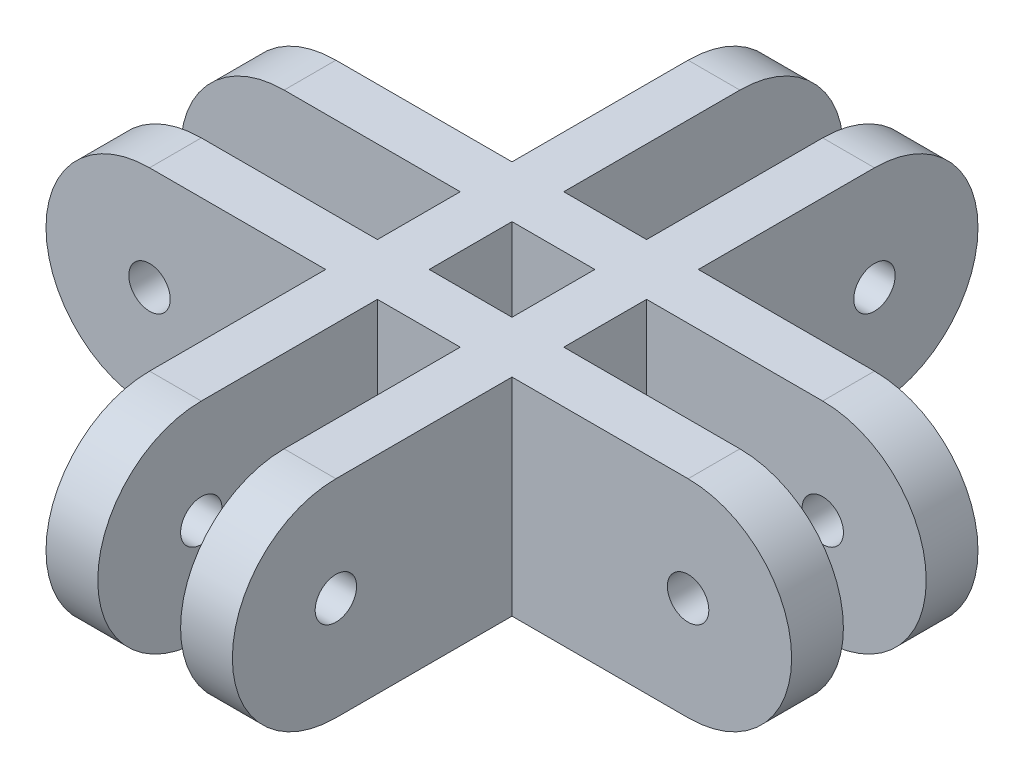
ISO-10303-21;
HEADER;
FILE_DESCRIPTION(('STEP AP214'),'2;1');
FILE_NAME('part.step','',(''),(''),'','','');
FILE_SCHEMA(('AUTOMOTIVE_DESIGN { 1 0 10303 214 1 1 1 1 }'));
ENDSEC;
DATA;
#1=APPLICATION_CONTEXT('core data for automotive mechanical design processes');
#2=APPLICATION_PROTOCOL_DEFINITION('international standard','automotive_design',2000,#1);
#3=PRODUCT_CONTEXT('',#1,'mechanical');
#4=PRODUCT('Part','Part','',(#3));
#5=PRODUCT_RELATED_PRODUCT_CATEGORY('part','',(#4));
#6=PRODUCT_DEFINITION_FORMATION('','',#4);
#7=PRODUCT_DEFINITION_CONTEXT('part definition',#1,'design');
#8=PRODUCT_DEFINITION('design','',#6,#7);
#9=PRODUCT_DEFINITION_SHAPE('','',#8);
#10=(LENGTH_UNIT() NAMED_UNIT(*) SI_UNIT(.MILLI.,.METRE.));
#11=(NAMED_UNIT(*) PLANE_ANGLE_UNIT() SI_UNIT($,.RADIAN.));
#12=(NAMED_UNIT(*) SI_UNIT($,.STERADIAN.) SOLID_ANGLE_UNIT());
#13=UNCERTAINTY_MEASURE_WITH_UNIT(LENGTH_MEASURE(1.E-05),#10,'distance_accuracy_value','');
#14=(GEOMETRIC_REPRESENTATION_CONTEXT(3) GLOBAL_UNCERTAINTY_ASSIGNED_CONTEXT((#13)) GLOBAL_UNIT_ASSIGNED_CONTEXT((#10,
#11,#12)) REPRESENTATION_CONTEXT('',''));
#15=CARTESIAN_POINT('',(0.,0.,0.));
#16=DIRECTION('',(0.,0.,1.));
#17=DIRECTION('',(1.,0.,0.));
#18=AXIS2_PLACEMENT_3D('',#15,#16,#17);
#19=CARTESIAN_POINT('',(0.,0.,5.));
#20=DIRECTION('',(0.,0.,1.));
#21=DIRECTION('',(1.,0.,0.));
#22=AXIS2_PLACEMENT_3D('',#19,#20,#21);
#23=PLANE('',#22);
#24=CARTESIAN_POINT('',(-52.02,0.,5.));
#25=DIRECTION('',(0.,0.,1.));
#26=DIRECTION('',(1.,0.,0.));
#27=AXIS2_PLACEMENT_3D('',#24,#25,#26);
#28=CIRCLE('',#27,2.);
#29=CARTESIAN_POINT('',(-50.02,0.,5.));
#30=VERTEX_POINT('',#29);
#31=EDGE_CURVE('E420',#30,#30,#28,.F.);
#32=ORIENTED_EDGE('',*,*,#31,.T.);
#33=EDGE_LOOP('',(#32));
#34=FACE_BOUND('',#33,.T.);
#35=DIRECTION('',(-1.,0.,0.));
#36=VECTOR('',#35,1.);
#37=CARTESIAN_POINT('',(0.,-10.,5.));
#38=LINE('',#37,#36);
#39=CARTESIAN_POINT('',(-35.01,-10.,5.));
#40=VERTEX_POINT('',#39);
#41=CARTESIAN_POINT('',(-52.02,-10.,5.));
#42=VERTEX_POINT('',#41);
#43=EDGE_CURVE('E408',#40,#42,#38,.T.);
#44=ORIENTED_EDGE('',*,*,#43,.F.);
#45=DIRECTION('',(0.,1.,0.));
#46=VECTOR('',#45,1.);
#47=CARTESIAN_POINT('',(-35.01,0.,5.));
#48=LINE('',#47,#46);
#49=CARTESIAN_POINT('',(-35.01,10.,5.));
#50=VERTEX_POINT('',#49);
#51=EDGE_CURVE('E280',#40,#50,#48,.T.);
#52=ORIENTED_EDGE('',*,*,#51,.T.);
#53=DIRECTION('',(-1.,0.,0.));
#54=VECTOR('',#53,1.);
#55=CARTESIAN_POINT('',(0.,10.,5.));
#56=LINE('',#55,#54);
#57=CARTESIAN_POINT('',(-52.02,10.,5.));
#58=VERTEX_POINT('',#57);
#59=EDGE_CURVE('E416',#50,#58,#56,.T.);
#60=ORIENTED_EDGE('',*,*,#59,.T.);
#61=CARTESIAN_POINT('',(-52.02,0.,5.));
#62=DIRECTION('',(0.,0.,1.));
#63=DIRECTION('',(1.,0.,0.));
#64=AXIS2_PLACEMENT_3D('',#61,#62,#63);
#65=CIRCLE('',#64,10.);
#66=EDGE_CURVE('E405',#42,#58,#65,.F.);
#67=ORIENTED_EDGE('',*,*,#66,.F.);
#68=EDGE_LOOP('',(#44,#52,#60,#67));
#69=FACE_BOUND('',#68,.T.);
#70=ADVANCED_FACE('F34',(#34,#69),#23,.T.);
#71=CARTESIAN_POINT('',(0.,0.,0.));
#72=DIRECTION('',(0.,0.,1.));
#73=DIRECTION('',(1.,0.,0.));
#74=AXIS2_PLACEMENT_3D('',#71,#72,#73);
#75=PLANE('',#74);
#76=CARTESIAN_POINT('',(-52.02,0.,0.));
#77=DIRECTION('',(0.,0.,1.));
#78=DIRECTION('',(1.,0.,0.));
#79=AXIS2_PLACEMENT_3D('',#76,#77,#78);
#80=CIRCLE('',#79,2.);
#81=CARTESIAN_POINT('',(-50.02,0.,0.));
#82=VERTEX_POINT('',#81);
#83=EDGE_CURVE('E440',#82,#82,#80,.F.);
#84=ORIENTED_EDGE('',*,*,#83,.F.);
#85=EDGE_LOOP('',(#84));
#86=FACE_BOUND('',#85,.T.);
#87=DIRECTION('',(0.,1.,0.));
#88=VECTOR('',#87,1.);
#89=CARTESIAN_POINT('',(-35.01,0.,0.));
#90=LINE('',#89,#88);
#91=CARTESIAN_POINT('',(-35.01,-10.,0.));
#92=VERTEX_POINT('',#91);
#93=CARTESIAN_POINT('',(-35.01,10.,0.));
#94=VERTEX_POINT('',#93);
#95=EDGE_CURVE('E49',#92,#94,#90,.T.);
#96=ORIENTED_EDGE('',*,*,#95,.F.);
#97=DIRECTION('',(-1.,0.,0.));
#98=VECTOR('',#97,1.);
#99=CARTESIAN_POINT('',(0.,-10.,0.));
#100=LINE('',#99,#98);
#101=CARTESIAN_POINT('',(-52.02,-10.,0.));
#102=VERTEX_POINT('',#101);
#103=EDGE_CURVE('E430',#92,#102,#100,.T.);
#104=ORIENTED_EDGE('',*,*,#103,.T.);
#105=CARTESIAN_POINT('',(-52.02,0.,0.));
#106=DIRECTION('',(0.,0.,1.));
#107=DIRECTION('',(1.,0.,0.));
#108=AXIS2_PLACEMENT_3D('',#105,#106,#107);
#109=CIRCLE('',#108,10.);
#110=CARTESIAN_POINT('',(-52.02,10.,0.));
#111=VERTEX_POINT('',#110);
#112=EDGE_CURVE('E404',#102,#111,#109,.F.);
#113=ORIENTED_EDGE('',*,*,#112,.T.);
#114=DIRECTION('',(-1.,0.,0.));
#115=VECTOR('',#114,1.);
#116=CARTESIAN_POINT('',(0.,10.,0.));
#117=LINE('',#116,#115);
#118=EDGE_CURVE('E436',#94,#111,#117,.T.);
#119=ORIENTED_EDGE('',*,*,#118,.F.);
#120=EDGE_LOOP('',(#96,#104,#113,#119));
#121=FACE_BOUND('',#120,.T.);
#122=ADVANCED_FACE('F555',(#86,#121),#75,.F.);
#123=CARTESIAN_POINT('',(-52.02,0.,18.));
#124=DIRECTION('',(0.,0.,-1.));
#125=DIRECTION('',(-1.,0.,0.));
#126=AXIS2_PLACEMENT_3D('',#123,#124,#125);
#127=PLANE('',#126);
#128=CARTESIAN_POINT('',(-52.02,0.,18.));
#129=DIRECTION('',(0.,0.,1.));
#130=DIRECTION('',(1.,0.,0.));
#131=AXIS2_PLACEMENT_3D('',#128,#129,#130);
#132=CIRCLE('',#131,1.99999999999999);
#133=CARTESIAN_POINT('',(-50.02,0.,18.));
#134=VERTEX_POINT('',#133);
#135=EDGE_CURVE('E295',#134,#134,#132,.T.);
#136=ORIENTED_EDGE('',*,*,#135,.F.);
#137=EDGE_LOOP('',(#136));
#138=FACE_BOUND('',#137,.T.);
#139=DIRECTION('',(0.,-1.,0.));
#140=VECTOR('',#139,1.);
#141=CARTESIAN_POINT('',(-35.01,0.,18.));
#142=LINE('',#141,#140);
#143=CARTESIAN_POINT('',(-35.01,10.,18.));
#144=VERTEX_POINT('',#143);
#145=CARTESIAN_POINT('',(-35.01,-10.,18.));
#146=VERTEX_POINT('',#145);
#147=EDGE_CURVE('E271',#144,#146,#142,.T.);
#148=ORIENTED_EDGE('',*,*,#147,.F.);
#149=DIRECTION('',(-1.,0.,0.));
#150=VECTOR('',#149,1.);
#151=CARTESIAN_POINT('',(-52.02,10.,18.));
#152=LINE('',#151,#150);
#153=CARTESIAN_POINT('',(-52.02,10.,18.));
#154=VERTEX_POINT('',#153);
#155=EDGE_CURVE('E311',#144,#154,#152,.T.);
#156=ORIENTED_EDGE('',*,*,#155,.T.);
#157=CARTESIAN_POINT('',(-52.02,0.,18.));
#158=DIRECTION('',(0.,0.,1.));
#159=DIRECTION('',(-1.,0.,0.));
#160=AXIS2_PLACEMENT_3D('',#157,#158,#159);
#161=CIRCLE('',#160,10.);
#162=CARTESIAN_POINT('',(-52.02,-10.,18.));
#163=VERTEX_POINT('',#162);
#164=EDGE_CURVE('E301',#154,#163,#161,.T.);
#165=ORIENTED_EDGE('',*,*,#164,.T.);
#166=DIRECTION('',(1.,0.,0.));
#167=VECTOR('',#166,1.);
#168=CARTESIAN_POINT('',(-52.02,-10.,18.));
#169=LINE('',#168,#167);
#170=EDGE_CURVE('E306',#163,#146,#169,.T.);
#171=ORIENTED_EDGE('',*,*,#170,.T.);
#172=EDGE_LOOP('',(#148,#156,#165,#171));
#173=FACE_BOUND('',#172,.T.);
#174=ADVANCED_FACE('F553',(#138,#173),#127,.F.);
#175=CARTESIAN_POINT('',(-52.02,0.,13.));
#176=DIRECTION('',(0.,0.,-1.));
#177=DIRECTION('',(-1.,0.,0.));
#178=AXIS2_PLACEMENT_3D('',#175,#176,#177);
#179=PLANE('',#178);
#180=CARTESIAN_POINT('',(-52.02,0.,13.));
#181=DIRECTION('',(0.,0.,1.));
#182=DIRECTION('',(1.,0.,0.));
#183=AXIS2_PLACEMENT_3D('',#180,#181,#182);
#184=CIRCLE('',#183,1.99999999999999);
#185=CARTESIAN_POINT('',(-50.02,0.,13.));
#186=VERTEX_POINT('',#185);
#187=EDGE_CURVE('E292',#186,#186,#184,.T.);
#188=ORIENTED_EDGE('',*,*,#187,.T.);
#189=EDGE_LOOP('',(#188));
#190=FACE_BOUND('',#189,.T.);
#191=DIRECTION('',(-1.,0.,0.));
#192=VECTOR('',#191,1.);
#193=CARTESIAN_POINT('',(-52.02,10.,13.));
#194=LINE('',#193,#192);
#195=CARTESIAN_POINT('',(-35.01,10.,13.));
#196=VERTEX_POINT('',#195);
#197=CARTESIAN_POINT('',(-52.02,10.,13.));
#198=VERTEX_POINT('',#197);
#199=EDGE_CURVE('E325',#196,#198,#194,.T.);
#200=ORIENTED_EDGE('',*,*,#199,.F.);
#201=DIRECTION('',(0.,-1.,0.));
#202=VECTOR('',#201,1.);
#203=CARTESIAN_POINT('',(-35.01,0.,13.));
#204=LINE('',#203,#202);
#205=CARTESIAN_POINT('',(-35.01,-10.,13.));
#206=VERTEX_POINT('',#205);
#207=EDGE_CURVE('E42',#196,#206,#204,.T.);
#208=ORIENTED_EDGE('',*,*,#207,.T.);
#209=DIRECTION('',(1.,0.,0.));
#210=VECTOR('',#209,1.);
#211=CARTESIAN_POINT('',(-52.02,-10.,13.));
#212=LINE('',#211,#210);
#213=CARTESIAN_POINT('',(-52.02,-10.,13.));
#214=VERTEX_POINT('',#213);
#215=EDGE_CURVE('E319',#214,#206,#212,.T.);
#216=ORIENTED_EDGE('',*,*,#215,.F.);
#217=CARTESIAN_POINT('',(-52.02,0.,13.));
#218=DIRECTION('',(0.,0.,1.));
#219=DIRECTION('',(-1.,0.,0.));
#220=AXIS2_PLACEMENT_3D('',#217,#218,#219);
#221=CIRCLE('',#220,10.);
#222=EDGE_CURVE('E298',#198,#214,#221,.T.);
#223=ORIENTED_EDGE('',*,*,#222,.F.);
#224=EDGE_LOOP('',(#200,#208,#216,#223));
#225=FACE_BOUND('',#224,.T.);
#226=ADVANCED_FACE('F469',(#190,#225),#179,.T.);
#227=CARTESIAN_POINT('',(-22.01,0.,0.));
#228=DIRECTION('',(1.,0.,0.));
#229=DIRECTION('',(0.,0.,-1.));
#230=AXIS2_PLACEMENT_3D('',#227,#228,#229);
#231=PLANE('',#230);
#232=CARTESIAN_POINT('',(-22.01,0.,35.01));
#233=DIRECTION('',(1.,0.,0.));
#234=DIRECTION('',(0.,0.,-1.));
#235=AXIS2_PLACEMENT_3D('',#232,#233,#234);
#236=CIRCLE('',#235,2.);
#237=CARTESIAN_POINT('',(-22.01,0.,33.01));
#238=VERTEX_POINT('',#237);
#239=EDGE_CURVE('E363',#238,#238,#236,.F.);
#240=ORIENTED_EDGE('',*,*,#239,.F.);
#241=EDGE_LOOP('',(#240));
#242=FACE_BOUND('',#241,.T.);
#243=DIRECTION('',(0.,1.,0.));
#244=VECTOR('',#243,1.);
#245=CARTESIAN_POINT('',(-22.01,0.,18.));
#246=LINE('',#245,#244);
#247=CARTESIAN_POINT('',(-22.01,-10.,18.));
#248=VERTEX_POINT('',#247);
#249=CARTESIAN_POINT('',(-22.01,10.,18.));
#250=VERTEX_POINT('',#249);
#251=EDGE_CURVE('E342',#248,#250,#246,.T.);
#252=ORIENTED_EDGE('',*,*,#251,.F.);
#253=DIRECTION('',(0.,0.,1.));
#254=VECTOR('',#253,1.);
#255=CARTESIAN_POINT('',(-22.01,-10.,0.));
#256=LINE('',#255,#254);
#257=CARTESIAN_POINT('',(-22.01,-10.,35.01));
#258=VERTEX_POINT('',#257);
#259=EDGE_CURVE('E353',#248,#258,#256,.T.);
#260=ORIENTED_EDGE('',*,*,#259,.T.);
#261=CARTESIAN_POINT('',(-22.01,0.,35.01));
#262=DIRECTION('',(1.,0.,0.));
#263=DIRECTION('',(0.,0.,-1.));
#264=AXIS2_PLACEMENT_3D('',#261,#262,#263);
#265=CIRCLE('',#264,10.);
#266=CARTESIAN_POINT('',(-22.01,10.,35.01));
#267=VERTEX_POINT('',#266);
#268=EDGE_CURVE('E349',#258,#267,#265,.F.);
#269=ORIENTED_EDGE('',*,*,#268,.T.);
#270=DIRECTION('',(0.,0.,-1.));
#271=VECTOR('',#270,1.);
#272=CARTESIAN_POINT('',(-22.01,10.,0.));
#273=LINE('',#272,#271);
#274=EDGE_CURVE('E361',#267,#250,#273,.T.);
#275=ORIENTED_EDGE('',*,*,#274,.T.);
#276=EDGE_LOOP('',(#252,#260,#269,#275));
#277=FACE_BOUND('',#276,.T.);
#278=ADVANCED_FACE('F564',(#242,#277),#231,.F.);
#279=CARTESIAN_POINT('',(-17.01,0.,0.));
#280=DIRECTION('',(1.,0.,0.));
#281=DIRECTION('',(0.,0.,-1.));
#282=AXIS2_PLACEMENT_3D('',#279,#280,#281);
#283=PLANE('',#282);
#284=CARTESIAN_POINT('',(-17.01,0.,35.01));
#285=DIRECTION('',(1.,0.,0.));
#286=DIRECTION('',(0.,0.,-1.));
#287=AXIS2_PLACEMENT_3D('',#284,#285,#286);
#288=CIRCLE('',#287,2.);
#289=CARTESIAN_POINT('',(-17.01,0.,33.01));
#290=VERTEX_POINT('',#289);
#291=EDGE_CURVE('E350',#290,#290,#288,.F.);
#292=ORIENTED_EDGE('',*,*,#291,.T.);
#293=EDGE_LOOP('',(#292));
#294=FACE_BOUND('',#293,.T.);
#295=DIRECTION('',(0.,0.,1.));
#296=VECTOR('',#295,1.);
#297=CARTESIAN_POINT('',(-17.01,-10.,0.));
#298=LINE('',#297,#296);
#299=CARTESIAN_POINT('',(-17.01,-10.,18.));
#300=VERTEX_POINT('',#299);
#301=CARTESIAN_POINT('',(-17.01,-10.,35.01));
#302=VERTEX_POINT('',#301);
#303=EDGE_CURVE('E373',#300,#302,#298,.T.);
#304=ORIENTED_EDGE('',*,*,#303,.F.);
#305=DIRECTION('',(0.,1.,0.));
#306=VECTOR('',#305,1.);
#307=CARTESIAN_POINT('',(-17.01,0.,18.));
#308=LINE('',#307,#306);
#309=CARTESIAN_POINT('',(-17.01,10.,18.));
#310=VERTEX_POINT('',#309);
#311=EDGE_CURVE('E464',#300,#310,#308,.T.);
#312=ORIENTED_EDGE('',*,*,#311,.T.);
#313=DIRECTION('',(0.,0.,-1.));
#314=VECTOR('',#313,1.);
#315=CARTESIAN_POINT('',(-17.01,10.,0.));
#316=LINE('',#315,#314);
#317=CARTESIAN_POINT('',(-17.01,10.,35.01));
#318=VERTEX_POINT('',#317);
#319=EDGE_CURVE('E382',#318,#310,#316,.T.);
#320=ORIENTED_EDGE('',*,*,#319,.F.);
#321=CARTESIAN_POINT('',(-17.01,0.,35.01));
#322=DIRECTION('',(1.,0.,0.));
#323=DIRECTION('',(0.,0.,-1.));
#324=AXIS2_PLACEMENT_3D('',#321,#322,#323);
#325=CIRCLE('',#324,10.);
#326=EDGE_CURVE('E370',#302,#318,#325,.F.);
#327=ORIENTED_EDGE('',*,*,#326,.F.);
#328=EDGE_LOOP('',(#304,#312,#320,#327));
#329=FACE_BOUND('',#328,.T.);
#330=ADVANCED_FACE('F587',(#294,#329),#283,.T.);
#331=DIRECTION('',(0.,1.,0.));
#332=VECTOR('',#331,1.);
#333=CARTESIAN_POINT('',(-30.01,0.,5.));
#334=LINE('',#333,#332);
#335=CARTESIAN_POINT('',(-30.01,-10.,5.));
#336=VERTEX_POINT('',#335);
#337=CARTESIAN_POINT('',(-30.01,10.,5.));
#338=VERTEX_POINT('',#337);
#339=EDGE_CURVE('E286',#336,#338,#334,.T.);
#340=ORIENTED_EDGE('',*,*,#339,.F.);
#341=CARTESIAN_POINT('',(-22.01,-10.,5.));
#342=VERTEX_POINT('',#341);
#343=EDGE_CURVE('E414',#342,#336,#38,.T.);
#344=ORIENTED_EDGE('',*,*,#343,.F.);
#345=DIRECTION('',(0.,1.,0.));
#346=VECTOR('',#345,1.);
#347=CARTESIAN_POINT('',(-22.01,0.,5.));
#348=LINE('',#347,#346);
#349=CARTESIAN_POINT('',(-22.01,10.,5.));
#350=VERTEX_POINT('',#349);
#351=EDGE_CURVE('E401',#342,#350,#348,.T.);
#352=ORIENTED_EDGE('',*,*,#351,.T.);
#353=EDGE_CURVE('E421',#350,#338,#56,.T.);
#354=ORIENTED_EDGE('',*,*,#353,.T.);
#355=EDGE_LOOP('',(#340,#344,#352,#354));
#356=FACE_BOUND('',#355,.T.);
#357=ADVANCED_FACE('F580',(#356),#23,.T.);
#358=CARTESIAN_POINT('',(-22.01,-10.,0.));
#359=VERTEX_POINT('',#358);
#360=CARTESIAN_POINT('',(-30.01,-10.,0.));
#361=VERTEX_POINT('',#360);
#362=EDGE_CURVE('E57',#359,#361,#100,.T.);
#363=ORIENTED_EDGE('',*,*,#362,.T.);
#364=DIRECTION('',(0.,1.,0.));
#365=VECTOR('',#364,1.);
#366=CARTESIAN_POINT('',(-30.01,0.,0.));
#367=LINE('',#366,#365);
#368=CARTESIAN_POINT('',(-30.01,10.,0.));
#369=VERTEX_POINT('',#368);
#370=EDGE_CURVE('E249',#361,#369,#367,.T.);
#371=ORIENTED_EDGE('',*,*,#370,.T.);
#372=CARTESIAN_POINT('',(-22.01,10.,0.));
#373=VERTEX_POINT('',#372);
#374=EDGE_CURVE('E441',#373,#369,#117,.T.);
#375=ORIENTED_EDGE('',*,*,#374,.F.);
#376=DIRECTION('',(0.,1.,0.));
#377=VECTOR('',#376,1.);
#378=CARTESIAN_POINT('',(-22.01,0.,0.));
#379=LINE('',#378,#377);
#380=EDGE_CURVE('E459',#359,#373,#379,.T.);
#381=ORIENTED_EDGE('',*,*,#380,.F.);
#382=EDGE_LOOP('',(#363,#371,#375,#381));
#383=FACE_BOUND('',#382,.T.);
#384=ADVANCED_FACE('F570',(#383),#75,.F.);
#385=CARTESIAN_POINT('',(-52.02,0.,5.));
#386=DIRECTION('',(0.,0.,-1.));
#387=DIRECTION('',(-1.,0.,0.));
#388=AXIS2_PLACEMENT_3D('',#385,#386,#387);
#389=CYLINDRICAL_SURFACE('',#388,10.);
#390=ORIENTED_EDGE('',*,*,#112,.F.);
#391=DIRECTION('',(0.,0.,-1.));
#392=VECTOR('',#391,1.);
#393=CARTESIAN_POINT('',(-52.02,-10.,5.));
#394=LINE('',#393,#392);
#395=EDGE_CURVE('E453',#42,#102,#394,.T.);
#396=ORIENTED_EDGE('',*,*,#395,.F.);
#397=ORIENTED_EDGE('',*,*,#66,.T.);
#398=DIRECTION('',(0.,0.,-1.));
#399=VECTOR('',#398,1.);
#400=CARTESIAN_POINT('',(-52.02,10.,5.));
#401=LINE('',#400,#399);
#402=EDGE_CURVE('E427',#58,#111,#401,.T.);
#403=ORIENTED_EDGE('',*,*,#402,.T.);
#404=EDGE_LOOP('',(#390,#396,#397,#403));
#405=FACE_BOUND('',#404,.T.);
#406=ADVANCED_FACE('F36',(#405),#389,.T.);
#407=CARTESIAN_POINT('',(0.,-10.,5.));
#408=DIRECTION('',(0.,-1.,0.));
#409=DIRECTION('',(0.,0.,-1.));
#410=AXIS2_PLACEMENT_3D('',#407,#408,#409);
#411=PLANE('',#410);
#412=DIRECTION('',(0.,0.,-1.));
#413=VECTOR('',#412,1.);
#414=CARTESIAN_POINT('',(-35.01,-10.,0.));
#415=LINE('',#414,#413);
#416=EDGE_CURVE('E473',#206,#40,#415,.T.);
#417=ORIENTED_EDGE('',*,*,#416,.T.);
#418=ORIENTED_EDGE('',*,*,#43,.T.);
#419=ORIENTED_EDGE('',*,*,#395,.T.);
#420=ORIENTED_EDGE('',*,*,#103,.F.);
#421=CARTESIAN_POINT('',(-35.01,-10.,-17.01));
#422=VERTEX_POINT('',#421);
#423=EDGE_CURVE('E269',#92,#422,#415,.T.);
#424=ORIENTED_EDGE('',*,*,#423,.T.);
#425=DIRECTION('',(-1.,0.,0.));
#426=VECTOR('',#425,1.);
#427=CARTESIAN_POINT('',(-30.01,-10.,-17.01));
#428=LINE('',#427,#426);
#429=CARTESIAN_POINT('',(-30.01,-10.,-17.01));
#430=VERTEX_POINT('',#429);
#431=EDGE_CURVE('E260',#430,#422,#428,.T.);
#432=ORIENTED_EDGE('',*,*,#431,.F.);
#433=DIRECTION('',(0.,0.,-1.));
#434=VECTOR('',#433,1.);
#435=CARTESIAN_POINT('',(-30.01,-10.,0.));
#436=LINE('',#435,#434);
#437=EDGE_CURVE('E243',#361,#430,#436,.T.);
#438=ORIENTED_EDGE('',*,*,#437,.F.);
#439=ORIENTED_EDGE('',*,*,#362,.F.);
#440=CARTESIAN_POINT('',(-22.01,-10.,-17.01));
#441=VERTEX_POINT('',#440);
#442=EDGE_CURVE('E354',#441,#359,#256,.T.);
#443=ORIENTED_EDGE('',*,*,#442,.F.);
#444=DIRECTION('',(1.,0.,0.));
#445=VECTOR('',#444,1.);
#446=CARTESIAN_POINT('',(-22.01,-10.,-17.01));
#447=LINE('',#446,#445);
#448=CARTESIAN_POINT('',(-17.01,-10.,-17.01));
#449=VERTEX_POINT('',#448);
#450=EDGE_CURVE('E395',#441,#449,#447,.T.);
#451=ORIENTED_EDGE('',*,*,#450,.T.);
#452=CARTESIAN_POINT('',(-17.01,-10.,0.));
#453=VERTEX_POINT('',#452);
#454=EDGE_CURVE('E374',#449,#453,#298,.T.);
#455=ORIENTED_EDGE('',*,*,#454,.T.);
#456=CARTESIAN_POINT('',(0.,-10.,0.));
#457=VERTEX_POINT('',#456);
#458=EDGE_CURVE('E431',#457,#453,#100,.T.);
#459=ORIENTED_EDGE('',*,*,#458,.F.);
#460=DIRECTION('',(0.,0.,-1.));
#461=VECTOR('',#460,1.);
#462=CARTESIAN_POINT('',(0.,-10.,5.));
#463=LINE('',#462,#461);
#464=CARTESIAN_POINT('',(0.,-10.,5.));
#465=VERTEX_POINT('',#464);
#466=EDGE_CURVE('E451',#465,#457,#463,.T.);
#467=ORIENTED_EDGE('',*,*,#466,.F.);
#468=CARTESIAN_POINT('',(-17.01,-10.,5.));
#469=VERTEX_POINT('',#468);
#470=EDGE_CURVE('E410',#465,#469,#38,.T.);
#471=ORIENTED_EDGE('',*,*,#470,.T.);
#472=CARTESIAN_POINT('',(-17.01,-10.,13.));
#473=VERTEX_POINT('',#472);
#474=EDGE_CURVE('E378',#469,#473,#298,.T.);
#475=ORIENTED_EDGE('',*,*,#474,.T.);
#476=CARTESIAN_POINT('',(0.,-10.,13.));
#477=VERTEX_POINT('',#476);
#478=EDGE_CURVE('E318',#473,#477,#212,.T.);
#479=ORIENTED_EDGE('',*,*,#478,.T.);
#480=DIRECTION('',(0.,0.,-1.));
#481=VECTOR('',#480,1.);
#482=CARTESIAN_POINT('',(0.,-10.,18.));
#483=LINE('',#482,#481);
#484=CARTESIAN_POINT('',(0.,-10.,18.));
#485=VERTEX_POINT('',#484);
#486=EDGE_CURVE('E333',#485,#477,#483,.T.);
#487=ORIENTED_EDGE('',*,*,#486,.F.);
#488=EDGE_CURVE('E304',#300,#485,#169,.T.);
#489=ORIENTED_EDGE('',*,*,#488,.F.);
#490=ORIENTED_EDGE('',*,*,#303,.T.);
#491=DIRECTION('',(1.,0.,0.));
#492=VECTOR('',#491,1.);
#493=CARTESIAN_POINT('',(-22.01,-10.,35.01));
#494=LINE('',#493,#492);
#495=EDGE_CURVE('E367',#258,#302,#494,.T.);
#496=ORIENTED_EDGE('',*,*,#495,.F.);
#497=ORIENTED_EDGE('',*,*,#259,.F.);
#498=CARTESIAN_POINT('',(-30.01,-10.,18.));
#499=VERTEX_POINT('',#498);
#500=EDGE_CURVE('E309',#499,#248,#169,.T.);
#501=ORIENTED_EDGE('',*,*,#500,.F.);
#502=CARTESIAN_POINT('',(-30.01,-10.,35.01));
#503=VERTEX_POINT('',#502);
#504=EDGE_CURVE('E255',#503,#499,#436,.T.);
#505=ORIENTED_EDGE('',*,*,#504,.F.);
#506=DIRECTION('',(-1.,0.,0.));
#507=VECTOR('',#506,1.);
#508=CARTESIAN_POINT('',(-30.01,-10.,35.01));
#509=LINE('',#508,#507);
#510=CARTESIAN_POINT('',(-35.01,-10.,35.01));
#511=VERTEX_POINT('',#510);
#512=EDGE_CURVE('E519',#503,#511,#509,.T.);
#513=ORIENTED_EDGE('',*,*,#512,.T.);
#514=EDGE_CURVE('E523',#511,#146,#415,.T.);
#515=ORIENTED_EDGE('',*,*,#514,.T.);
#516=ORIENTED_EDGE('',*,*,#170,.F.);
#517=DIRECTION('',(0.,0.,-1.));
#518=VECTOR('',#517,1.);
#519=CARTESIAN_POINT('',(-52.02,-10.,18.));
#520=LINE('',#519,#518);
#521=EDGE_CURVE('E336',#163,#214,#520,.T.);
#522=ORIENTED_EDGE('',*,*,#521,.T.);
#523=ORIENTED_EDGE('',*,*,#215,.T.);
#524=EDGE_LOOP('',(#417,#418,#419,#420,#424,#432,#438,#439,#443,#451,#455,#459,#467,#471,#475,
#479,#487,#489,#490,#496,#497,#501,#505,#513,#515,#516,#522,#523));
#525=FACE_BOUND('',#524,.T.);
#526=ORIENTED_EDGE('',*,*,#343,.T.);
#527=CARTESIAN_POINT('',(-30.01,-10.,13.));
#528=VERTEX_POINT('',#527);
#529=EDGE_CURVE('E252',#528,#336,#436,.T.);
#530=ORIENTED_EDGE('',*,*,#529,.F.);
#531=CARTESIAN_POINT('',(-22.01,-10.,13.));
#532=VERTEX_POINT('',#531);
#533=EDGE_CURVE('E323',#528,#532,#212,.T.);
#534=ORIENTED_EDGE('',*,*,#533,.T.);
#535=EDGE_CURVE('E357',#342,#532,#256,.T.);
#536=ORIENTED_EDGE('',*,*,#535,.F.);
#537=EDGE_LOOP('',(#526,#530,#534,#536));
#538=FACE_BOUND('',#537,.T.);
#539=ADVANCED_FACE('F266',(#525,#538),#411,.T.);
#540=CARTESIAN_POINT('',(0.,0.,5.));
#541=DIRECTION('',(0.,0.,-1.));
#542=DIRECTION('',(-1.,0.,0.));
#543=AXIS2_PLACEMENT_3D('',#540,#541,#542);
#544=CYLINDRICAL_SURFACE('',#543,10.);
#545=CARTESIAN_POINT('',(0.,0.,0.));
#546=DIRECTION('',(0.,0.,1.));
#547=DIRECTION('',(1.,0.,0.));
#548=AXIS2_PLACEMENT_3D('',#545,#546,#547);
#549=CIRCLE('',#548,10.);
#550=CARTESIAN_POINT('',(0.,10.,0.));
#551=VERTEX_POINT('',#550);
#552=EDGE_CURVE('E434',#457,#551,#549,.T.);
#553=ORIENTED_EDGE('',*,*,#552,.T.);
#554=DIRECTION('',(0.,0.,-1.));
#555=VECTOR('',#554,1.);
#556=CARTESIAN_POINT('',(0.,10.,5.));
#557=LINE('',#556,#555);
#558=CARTESIAN_POINT('',(0.,10.,5.));
#559=VERTEX_POINT('',#558);
#560=EDGE_CURVE('E448',#559,#551,#557,.T.);
#561=ORIENTED_EDGE('',*,*,#560,.F.);
#562=CARTESIAN_POINT('',(0.,0.,5.));
#563=DIRECTION('',(0.,0.,1.));
#564=DIRECTION('',(1.,0.,0.));
#565=AXIS2_PLACEMENT_3D('',#562,#563,#564);
#566=CIRCLE('',#565,10.);
#567=EDGE_CURVE('E413',#465,#559,#566,.T.);
#568=ORIENTED_EDGE('',*,*,#567,.F.);
#569=ORIENTED_EDGE('',*,*,#466,.T.);
#570=EDGE_LOOP('',(#553,#561,#568,#569));
#571=FACE_BOUND('',#570,.T.);
#572=ADVANCED_FACE('F648',(#571),#544,.T.);
#573=CARTESIAN_POINT('',(-52.02,0.,5.));
#574=DIRECTION('',(0.,0.,-1.));
#575=DIRECTION('',(-1.,0.,0.));
#576=AXIS2_PLACEMENT_3D('',#573,#574,#575);
#577=CYLINDRICAL_SURFACE('',#576,2.);
#578=ORIENTED_EDGE('',*,*,#31,.F.);
#579=EDGE_LOOP('',(#578));
#580=FACE_BOUND('',#579,.T.);
#581=ORIENTED_EDGE('',*,*,#83,.T.);
#582=EDGE_LOOP('',(#581));
#583=FACE_BOUND('',#582,.T.);
#584=ADVANCED_FACE('F650',(#580,#583),#577,.F.);
#585=CARTESIAN_POINT('',(0.,10.,5.));
#586=DIRECTION('',(0.,-1.,0.));
#587=DIRECTION('',(0.,0.,-1.));
#588=AXIS2_PLACEMENT_3D('',#585,#586,#587);
#589=PLANE('',#588);
#590=ORIENTED_EDGE('',*,*,#59,.F.);
#591=DIRECTION('',(0.,0.,-1.));
#592=VECTOR('',#591,1.);
#593=CARTESIAN_POINT('',(-35.01,10.,0.));
#594=LINE('',#593,#592);
#595=EDGE_CURVE('E488',#196,#50,#594,.T.);
#596=ORIENTED_EDGE('',*,*,#595,.F.);
#597=ORIENTED_EDGE('',*,*,#199,.T.);
#598=DIRECTION('',(0.,0.,-1.));
#599=VECTOR('',#598,1.);
#600=CARTESIAN_POINT('',(-52.02,10.,18.));
#601=LINE('',#600,#599);
#602=EDGE_CURVE('E314',#154,#198,#601,.T.);
#603=ORIENTED_EDGE('',*,*,#602,.F.);
#604=ORIENTED_EDGE('',*,*,#155,.F.);
#605=CARTESIAN_POINT('',(-35.01,10.,35.01));
#606=VERTEX_POINT('',#605);
#607=EDGE_CURVE('E528',#606,#144,#594,.T.);
#608=ORIENTED_EDGE('',*,*,#607,.F.);
#609=DIRECTION('',(-1.,0.,0.));
#610=VECTOR('',#609,1.);
#611=CARTESIAN_POINT('',(-30.01,10.,35.01));
#612=LINE('',#611,#610);
#613=CARTESIAN_POINT('',(-30.01,10.,35.01));
#614=VERTEX_POINT('',#613);
#615=EDGE_CURVE('E275',#614,#606,#612,.T.);
#616=ORIENTED_EDGE('',*,*,#615,.F.);
#617=DIRECTION('',(0.,0.,-1.));
#618=VECTOR('',#617,1.);
#619=CARTESIAN_POINT('',(-30.01,10.,0.));
#620=LINE('',#619,#618);
#621=CARTESIAN_POINT('',(-30.01,10.,18.));
#622=VERTEX_POINT('',#621);
#623=EDGE_CURVE('E510',#614,#622,#620,.T.);
#624=ORIENTED_EDGE('',*,*,#623,.T.);
#625=EDGE_CURVE('E315',#250,#622,#152,.T.);
#626=ORIENTED_EDGE('',*,*,#625,.F.);
#627=ORIENTED_EDGE('',*,*,#274,.F.);
#628=DIRECTION('',(1.,0.,0.));
#629=VECTOR('',#628,1.);
#630=CARTESIAN_POINT('',(-22.01,10.,35.01));
#631=LINE('',#630,#629);
#632=EDGE_CURVE('E388',#267,#318,#631,.T.);
#633=ORIENTED_EDGE('',*,*,#632,.T.);
#634=ORIENTED_EDGE('',*,*,#319,.T.);
#635=CARTESIAN_POINT('',(0.,10.,18.));
#636=VERTEX_POINT('',#635);
#637=EDGE_CURVE('E312',#636,#310,#152,.T.);
#638=ORIENTED_EDGE('',*,*,#637,.F.);
#639=DIRECTION('',(0.,0.,-1.));
#640=VECTOR('',#639,1.);
#641=CARTESIAN_POINT('',(0.,10.,18.));
#642=LINE('',#641,#640);
#643=CARTESIAN_POINT('',(0.,10.,13.));
#644=VERTEX_POINT('',#643);
#645=EDGE_CURVE('E330',#636,#644,#642,.T.);
#646=ORIENTED_EDGE('',*,*,#645,.T.);
#647=CARTESIAN_POINT('',(-17.01,10.,13.));
#648=VERTEX_POINT('',#647);
#649=EDGE_CURVE('E305',#644,#648,#194,.T.);
#650=ORIENTED_EDGE('',*,*,#649,.T.);
#651=CARTESIAN_POINT('',(-17.01,10.,5.));
#652=VERTEX_POINT('',#651);
#653=EDGE_CURVE('E385',#648,#652,#316,.T.);
#654=ORIENTED_EDGE('',*,*,#653,.T.);
#655=EDGE_CURVE('E417',#559,#652,#56,.T.);
#656=ORIENTED_EDGE('',*,*,#655,.F.);
#657=ORIENTED_EDGE('',*,*,#560,.T.);
#658=CARTESIAN_POINT('',(-17.01,10.,0.));
#659=VERTEX_POINT('',#658);
#660=EDGE_CURVE('E437',#551,#659,#117,.T.);
#661=ORIENTED_EDGE('',*,*,#660,.T.);
#662=CARTESIAN_POINT('',(-17.01,10.,-17.01));
#663=VERTEX_POINT('',#662);
#664=EDGE_CURVE('E381',#659,#663,#316,.T.);
#665=ORIENTED_EDGE('',*,*,#664,.T.);
#666=DIRECTION('',(1.,0.,0.));
#667=VECTOR('',#666,1.);
#668=CARTESIAN_POINT('',(-22.01,10.,-17.01));
#669=LINE('',#668,#667);
#670=CARTESIAN_POINT('',(-22.01,10.,-17.01));
#671=VERTEX_POINT('',#670);
#672=EDGE_CURVE('E392',#671,#663,#669,.T.);
#673=ORIENTED_EDGE('',*,*,#672,.F.);
#674=EDGE_CURVE('E360',#373,#671,#273,.T.);
#675=ORIENTED_EDGE('',*,*,#674,.F.);
#676=ORIENTED_EDGE('',*,*,#374,.T.);
#677=CARTESIAN_POINT('',(-30.01,10.,-17.01));
#678=VERTEX_POINT('',#677);
#679=EDGE_CURVE('E263',#369,#678,#620,.T.);
#680=ORIENTED_EDGE('',*,*,#679,.T.);
#681=DIRECTION('',(-1.,0.,0.));
#682=VECTOR('',#681,1.);
#683=CARTESIAN_POINT('',(-30.01,10.,-17.01));
#684=LINE('',#683,#682);
#685=CARTESIAN_POINT('',(-35.01,10.,-17.01));
#686=VERTEX_POINT('',#685);
#687=EDGE_CURVE('E262',#678,#686,#684,.T.);
#688=ORIENTED_EDGE('',*,*,#687,.T.);
#689=EDGE_CURVE('E527',#94,#686,#594,.T.);
#690=ORIENTED_EDGE('',*,*,#689,.F.);
#691=ORIENTED_EDGE('',*,*,#118,.T.);
#692=ORIENTED_EDGE('',*,*,#402,.F.);
#693=EDGE_LOOP('',(#590,#596,#597,#603,#604,#608,#616,#624,#626,#627,#633,#634,#638,#646,#650,
#654,#656,#657,#661,#665,#673,#675,#676,#680,#688,#690,#691,#692));
#694=FACE_BOUND('',#693,.T.);
#695=CARTESIAN_POINT('',(-30.01,10.,13.));
#696=VERTEX_POINT('',#695);
#697=EDGE_CURVE('E493',#696,#338,#620,.T.);
#698=ORIENTED_EDGE('',*,*,#697,.T.);
#699=ORIENTED_EDGE('',*,*,#353,.F.);
#700=CARTESIAN_POINT('',(-22.01,10.,13.));
#701=VERTEX_POINT('',#700);
#702=EDGE_CURVE('E364',#701,#350,#273,.T.);
#703=ORIENTED_EDGE('',*,*,#702,.F.);
#704=EDGE_CURVE('E327',#701,#696,#194,.T.);
#705=ORIENTED_EDGE('',*,*,#704,.T.);
#706=EDGE_LOOP('',(#698,#699,#703,#705));
#707=FACE_BOUND('',#706,.T.);
#708=ADVANCED_FACE('F484',(#694,#707),#589,.F.);
#709=CARTESIAN_POINT('',(0.,0.,5.));
#710=DIRECTION('',(0.,0.,-1.));
#711=DIRECTION('',(-1.,0.,0.));
#712=AXIS2_PLACEMENT_3D('',#709,#710,#711);
#713=CYLINDRICAL_SURFACE('',#712,2.);
#714=CARTESIAN_POINT('',(0.,0.,5.));
#715=DIRECTION('',(0.,0.,1.));
#716=DIRECTION('',(1.,0.,0.));
#717=AXIS2_PLACEMENT_3D('',#714,#715,#716);
#718=CIRCLE('',#717,2.);
#719=CARTESIAN_POINT('',(2.,0.,5.));
#720=VERTEX_POINT('',#719);
#721=EDGE_CURVE('E424',#720,#720,#718,.T.);
#722=ORIENTED_EDGE('',*,*,#721,.T.);
#723=EDGE_LOOP('',(#722));
#724=FACE_BOUND('',#723,.T.);
#725=CARTESIAN_POINT('',(0.,0.,0.));
#726=DIRECTION('',(0.,0.,1.));
#727=DIRECTION('',(1.,0.,0.));
#728=AXIS2_PLACEMENT_3D('',#725,#726,#727);
#729=CIRCLE('',#728,2.);
#730=CARTESIAN_POINT('',(2.,0.,0.));
#731=VERTEX_POINT('',#730);
#732=EDGE_CURVE('E409',#731,#731,#729,.T.);
#733=ORIENTED_EDGE('',*,*,#732,.F.);
#734=EDGE_LOOP('',(#733));
#735=FACE_BOUND('',#734,.T.);
#736=ADVANCED_FACE('F590',(#724,#735),#713,.F.);
#737=DIRECTION('',(0.,1.,0.));
#738=VECTOR('',#737,1.);
#739=CARTESIAN_POINT('',(-17.01,0.,5.));
#740=LINE('',#739,#738);
#741=EDGE_CURVE('E391',#469,#652,#740,.T.);
#742=ORIENTED_EDGE('',*,*,#741,.F.);
#743=ORIENTED_EDGE('',*,*,#470,.F.);
#744=ORIENTED_EDGE('',*,*,#567,.T.);
#745=ORIENTED_EDGE('',*,*,#655,.T.);
#746=EDGE_LOOP('',(#742,#743,#744,#745));
#747=FACE_BOUND('',#746,.T.);
#748=ORIENTED_EDGE('',*,*,#721,.F.);
#749=EDGE_LOOP('',(#748));
#750=FACE_BOUND('',#749,.T.);
#751=ADVANCED_FACE('F581',(#747,#750),#23,.T.);
#752=ORIENTED_EDGE('',*,*,#458,.T.);
#753=DIRECTION('',(0.,1.,0.));
#754=VECTOR('',#753,1.);
#755=CARTESIAN_POINT('',(-17.01,0.,0.));
#756=LINE('',#755,#754);
#757=EDGE_CURVE('E456',#453,#659,#756,.T.);
#758=ORIENTED_EDGE('',*,*,#757,.T.);
#759=ORIENTED_EDGE('',*,*,#660,.F.);
#760=ORIENTED_EDGE('',*,*,#552,.F.);
#761=EDGE_LOOP('',(#752,#758,#759,#760));
#762=FACE_BOUND('',#761,.T.);
#763=ORIENTED_EDGE('',*,*,#732,.T.);
#764=EDGE_LOOP('',(#763));
#765=FACE_BOUND('',#764,.T.);
#766=ADVANCED_FACE('F571',(#762,#765),#75,.F.);
#767=CARTESIAN_POINT('',(-22.01,0.,-17.01));
#768=DIRECTION('',(1.,0.,0.));
#769=DIRECTION('',(0.,0.,-1.));
#770=AXIS2_PLACEMENT_3D('',#767,#768,#769);
#771=CYLINDRICAL_SURFACE('',#770,10.);
#772=CARTESIAN_POINT('',(-17.01,0.,-17.01));
#773=DIRECTION('',(1.,0.,0.));
#774=DIRECTION('',(0.,0.,-1.));
#775=AXIS2_PLACEMENT_3D('',#772,#773,#774);
#776=CIRCLE('',#775,10.);
#777=EDGE_CURVE('E377',#449,#663,#776,.T.);
#778=ORIENTED_EDGE('',*,*,#777,.F.);
#779=ORIENTED_EDGE('',*,*,#450,.F.);
#780=CARTESIAN_POINT('',(-22.01,0.,-17.01));
#781=DIRECTION('',(1.,0.,0.));
#782=DIRECTION('',(0.,0.,-1.));
#783=AXIS2_PLACEMENT_3D('',#780,#781,#782);
#784=CIRCLE('',#783,10.);
#785=EDGE_CURVE('E356',#441,#671,#784,.T.);
#786=ORIENTED_EDGE('',*,*,#785,.T.);
#787=ORIENTED_EDGE('',*,*,#672,.T.);
#788=EDGE_LOOP('',(#778,#779,#786,#787));
#789=FACE_BOUND('',#788,.T.);
#790=ADVANCED_FACE('F596',(#789),#771,.T.);
#791=CARTESIAN_POINT('',(-22.01,0.,-17.01));
#792=DIRECTION('',(1.,0.,0.));
#793=DIRECTION('',(0.,0.,-1.));
#794=AXIS2_PLACEMENT_3D('',#791,#792,#793);
#795=CYLINDRICAL_SURFACE('',#794,2.);
#796=CARTESIAN_POINT('',(-22.01,0.,-17.01));
#797=DIRECTION('',(1.,0.,0.));
#798=DIRECTION('',(0.,0.,-1.));
#799=AXIS2_PLACEMENT_3D('',#796,#797,#798);
#800=CIRCLE('',#799,2.);
#801=CARTESIAN_POINT('',(-22.01,0.,-19.01));
#802=VERTEX_POINT('',#801);
#803=EDGE_CURVE('E346',#802,#802,#800,.T.);
#804=ORIENTED_EDGE('',*,*,#803,.F.);
#805=EDGE_LOOP('',(#804));
#806=FACE_BOUND('',#805,.T.);
#807=CARTESIAN_POINT('',(-17.01,0.,-17.01));
#808=DIRECTION('',(1.,0.,0.));
#809=DIRECTION('',(0.,0.,-1.));
#810=AXIS2_PLACEMENT_3D('',#807,#808,#809);
#811=CIRCLE('',#810,2.);
#812=CARTESIAN_POINT('',(-17.01,0.,-19.01));
#813=VERTEX_POINT('',#812);
#814=EDGE_CURVE('E345',#813,#813,#811,.T.);
#815=ORIENTED_EDGE('',*,*,#814,.T.);
#816=EDGE_LOOP('',(#815));
#817=FACE_BOUND('',#816,.T.);
#818=ADVANCED_FACE('F719',(#806,#817),#795,.F.);
#819=ORIENTED_EDGE('',*,*,#803,.T.);
#820=EDGE_LOOP('',(#819));
#821=FACE_BOUND('',#820,.T.);
#822=ORIENTED_EDGE('',*,*,#442,.T.);
#823=ORIENTED_EDGE('',*,*,#380,.T.);
#824=ORIENTED_EDGE('',*,*,#674,.T.);
#825=ORIENTED_EDGE('',*,*,#785,.F.);
#826=EDGE_LOOP('',(#822,#823,#824,#825));
#827=FACE_BOUND('',#826,.T.);
#828=ADVANCED_FACE('F685',(#821,#827),#231,.F.);
#829=ORIENTED_EDGE('',*,*,#814,.F.);
#830=EDGE_LOOP('',(#829));
#831=FACE_BOUND('',#830,.T.);
#832=ORIENTED_EDGE('',*,*,#757,.F.);
#833=ORIENTED_EDGE('',*,*,#454,.F.);
#834=ORIENTED_EDGE('',*,*,#777,.T.);
#835=ORIENTED_EDGE('',*,*,#664,.F.);
#836=EDGE_LOOP('',(#832,#833,#834,#835));
#837=FACE_BOUND('',#836,.T.);
#838=ADVANCED_FACE('F643',(#831,#837),#283,.T.);
#839=CARTESIAN_POINT('',(-22.01,0.,35.01));
#840=DIRECTION('',(1.,0.,0.));
#841=DIRECTION('',(0.,0.,-1.));
#842=AXIS2_PLACEMENT_3D('',#839,#840,#841);
#843=CYLINDRICAL_SURFACE('',#842,10.);
#844=ORIENTED_EDGE('',*,*,#326,.T.);
#845=ORIENTED_EDGE('',*,*,#632,.F.);
#846=ORIENTED_EDGE('',*,*,#268,.F.);
#847=ORIENTED_EDGE('',*,*,#495,.T.);
#848=EDGE_LOOP('',(#844,#845,#846,#847));
#849=FACE_BOUND('',#848,.T.);
#850=ADVANCED_FACE('F623',(#849),#843,.T.);
#851=CARTESIAN_POINT('',(-22.01,0.,35.01));
#852=DIRECTION('',(1.,0.,0.));
#853=DIRECTION('',(0.,0.,-1.));
#854=AXIS2_PLACEMENT_3D('',#851,#852,#853);
#855=CYLINDRICAL_SURFACE('',#854,2.);
#856=ORIENTED_EDGE('',*,*,#239,.T.);
#857=EDGE_LOOP('',(#856));
#858=FACE_BOUND('',#857,.T.);
#859=ORIENTED_EDGE('',*,*,#291,.F.);
#860=EDGE_LOOP('',(#859));
#861=FACE_BOUND('',#860,.T.);
#862=ADVANCED_FACE('F757',(#858,#861),#855,.F.);
#863=ORIENTED_EDGE('',*,*,#535,.T.);
#864=DIRECTION('',(0.,1.,0.));
#865=VECTOR('',#864,1.);
#866=CARTESIAN_POINT('',(-22.01,0.,13.));
#867=LINE('',#866,#865);
#868=EDGE_CURVE('E339',#532,#701,#867,.T.);
#869=ORIENTED_EDGE('',*,*,#868,.T.);
#870=ORIENTED_EDGE('',*,*,#702,.T.);
#871=ORIENTED_EDGE('',*,*,#351,.F.);
#872=EDGE_LOOP('',(#863,#869,#870,#871));
#873=FACE_BOUND('',#872,.T.);
#874=ADVANCED_FACE('F686',(#873),#231,.F.);
#875=DIRECTION('',(0.,1.,0.));
#876=VECTOR('',#875,1.);
#877=CARTESIAN_POINT('',(-17.01,0.,13.));
#878=LINE('',#877,#876);
#879=EDGE_CURVE('E461',#473,#648,#878,.T.);
#880=ORIENTED_EDGE('',*,*,#879,.F.);
#881=ORIENTED_EDGE('',*,*,#474,.F.);
#882=ORIENTED_EDGE('',*,*,#741,.T.);
#883=ORIENTED_EDGE('',*,*,#653,.F.);
#884=EDGE_LOOP('',(#880,#881,#882,#883));
#885=FACE_BOUND('',#884,.T.);
#886=ADVANCED_FACE('F614',(#885),#283,.T.);
#887=CARTESIAN_POINT('',(0.,0.,18.));
#888=DIRECTION('',(0.,0.,-1.));
#889=DIRECTION('',(-1.,0.,0.));
#890=AXIS2_PLACEMENT_3D('',#887,#888,#889);
#891=CYLINDRICAL_SURFACE('',#890,2.);
#892=CARTESIAN_POINT('',(0.,0.,18.));
#893=DIRECTION('',(0.,0.,1.));
#894=DIRECTION('',(1.,0.,0.));
#895=AXIS2_PLACEMENT_3D('',#892,#893,#894);
#896=CIRCLE('',#895,2.);
#897=CARTESIAN_POINT('',(1.99999999999999,0.,18.));
#898=VERTEX_POINT('',#897);
#899=EDGE_CURVE('E289',#898,#898,#896,.T.);
#900=ORIENTED_EDGE('',*,*,#899,.T.);
#901=EDGE_LOOP('',(#900));
#902=FACE_BOUND('',#901,.T.);
#903=CARTESIAN_POINT('',(0.,0.,13.));
#904=DIRECTION('',(0.,0.,1.));
#905=DIRECTION('',(1.,0.,0.));
#906=AXIS2_PLACEMENT_3D('',#903,#904,#905);
#907=CIRCLE('',#906,2.);
#908=CARTESIAN_POINT('',(1.99999999999999,0.,13.));
#909=VERTEX_POINT('',#908);
#910=EDGE_CURVE('E288',#909,#909,#907,.T.);
#911=ORIENTED_EDGE('',*,*,#910,.F.);
#912=EDGE_LOOP('',(#911));
#913=FACE_BOUND('',#912,.T.);
#914=ADVANCED_FACE('F786',(#902,#913),#891,.F.);
#915=CARTESIAN_POINT('',(0.,0.,18.));
#916=DIRECTION('',(0.,0.,-1.));
#917=DIRECTION('',(-1.,0.,0.));
#918=AXIS2_PLACEMENT_3D('',#915,#916,#917);
#919=CYLINDRICAL_SURFACE('',#918,10.);
#920=CARTESIAN_POINT('',(0.,0.,13.));
#921=DIRECTION('',(0.,0.,1.));
#922=DIRECTION('',(1.,0.,0.));
#923=AXIS2_PLACEMENT_3D('',#920,#921,#922);
#924=CIRCLE('',#923,10.);
#925=EDGE_CURVE('E322',#477,#644,#924,.T.);
#926=ORIENTED_EDGE('',*,*,#925,.T.);
#927=ORIENTED_EDGE('',*,*,#645,.F.);
#928=CARTESIAN_POINT('',(0.,0.,18.));
#929=DIRECTION('',(0.,0.,1.));
#930=DIRECTION('',(1.,0.,0.));
#931=AXIS2_PLACEMENT_3D('',#928,#929,#930);
#932=CIRCLE('',#931,10.);
#933=EDGE_CURVE('E308',#485,#636,#932,.T.);
#934=ORIENTED_EDGE('',*,*,#933,.F.);
#935=ORIENTED_EDGE('',*,*,#486,.T.);
#936=EDGE_LOOP('',(#926,#927,#934,#935));
#937=FACE_BOUND('',#936,.T.);
#938=ADVANCED_FACE('F631',(#937),#919,.T.);
#939=ORIENTED_EDGE('',*,*,#478,.F.);
#940=ORIENTED_EDGE('',*,*,#879,.T.);
#941=ORIENTED_EDGE('',*,*,#649,.F.);
#942=ORIENTED_EDGE('',*,*,#925,.F.);
#943=EDGE_LOOP('',(#939,#940,#941,#942));
#944=FACE_BOUND('',#943,.T.);
#945=ORIENTED_EDGE('',*,*,#910,.T.);
#946=EDGE_LOOP('',(#945));
#947=FACE_BOUND('',#946,.T.);
#948=ADVANCED_FACE('F567',(#944,#947),#179,.T.);
#949=ORIENTED_EDGE('',*,*,#311,.F.);
#950=ORIENTED_EDGE('',*,*,#488,.T.);
#951=ORIENTED_EDGE('',*,*,#933,.T.);
#952=ORIENTED_EDGE('',*,*,#637,.T.);
#953=EDGE_LOOP('',(#949,#950,#951,#952));
#954=FACE_BOUND('',#953,.T.);
#955=ORIENTED_EDGE('',*,*,#899,.F.);
#956=EDGE_LOOP('',(#955));
#957=FACE_BOUND('',#956,.T.);
#958=ADVANCED_FACE('F559',(#954,#957),#127,.F.);
#959=ORIENTED_EDGE('',*,*,#625,.T.);
#960=DIRECTION('',(0.,-1.,0.));
#961=VECTOR('',#960,1.);
#962=CARTESIAN_POINT('',(-30.01,0.,18.));
#963=LINE('',#962,#961);
#964=EDGE_CURVE('E283',#622,#499,#963,.T.);
#965=ORIENTED_EDGE('',*,*,#964,.T.);
#966=ORIENTED_EDGE('',*,*,#500,.T.);
#967=ORIENTED_EDGE('',*,*,#251,.T.);
#968=EDGE_LOOP('',(#959,#965,#966,#967));
#969=FACE_BOUND('',#968,.T.);
#970=ADVANCED_FACE('F558',(#969),#127,.F.);
#971=DIRECTION('',(0.,-1.,0.));
#972=VECTOR('',#971,1.);
#973=CARTESIAN_POINT('',(-30.01,0.,13.));
#974=LINE('',#973,#972);
#975=EDGE_CURVE('E11',#696,#528,#974,.T.);
#976=ORIENTED_EDGE('',*,*,#975,.F.);
#977=ORIENTED_EDGE('',*,*,#704,.F.);
#978=ORIENTED_EDGE('',*,*,#868,.F.);
#979=ORIENTED_EDGE('',*,*,#533,.F.);
#980=EDGE_LOOP('',(#976,#977,#978,#979));
#981=FACE_BOUND('',#980,.T.);
#982=ADVANCED_FACE('F498',(#981),#179,.T.);
#983=CARTESIAN_POINT('',(-52.02,0.,18.));
#984=DIRECTION('',(0.,0.,-1.));
#985=DIRECTION('',(-1.,0.,0.));
#986=AXIS2_PLACEMENT_3D('',#983,#984,#985);
#987=CYLINDRICAL_SURFACE('',#986,10.);
#988=ORIENTED_EDGE('',*,*,#222,.T.);
#989=ORIENTED_EDGE('',*,*,#521,.F.);
#990=ORIENTED_EDGE('',*,*,#164,.F.);
#991=ORIENTED_EDGE('',*,*,#602,.T.);
#992=EDGE_LOOP('',(#988,#989,#990,#991));
#993=FACE_BOUND('',#992,.T.);
#994=ADVANCED_FACE('F479',(#993),#987,.T.);
#995=CARTESIAN_POINT('',(-52.02,0.,18.));
#996=DIRECTION('',(0.,0.,-1.));
#997=DIRECTION('',(-1.,0.,0.));
#998=AXIS2_PLACEMENT_3D('',#995,#996,#997);
#999=CYLINDRICAL_SURFACE('',#998,1.99999999999999);
#1000=ORIENTED_EDGE('',*,*,#135,.T.);
#1001=EDGE_LOOP('',(#1000));
#1002=FACE_BOUND('',#1001,.T.);
#1003=ORIENTED_EDGE('',*,*,#187,.F.);
#1004=EDGE_LOOP('',(#1003));
#1005=FACE_BOUND('',#1004,.T.);
#1006=ADVANCED_FACE('F829',(#1002,#1005),#999,.F.);
#1007=CARTESIAN_POINT('',(-35.01,0.,0.));
#1008=DIRECTION('',(1.,0.,0.));
#1009=DIRECTION('',(0.,0.,-1.));
#1010=AXIS2_PLACEMENT_3D('',#1007,#1008,#1009);
#1011=PLANE('',#1010);
#1012=ORIENTED_EDGE('',*,*,#51,.F.);
#1013=ORIENTED_EDGE('',*,*,#416,.F.);
#1014=ORIENTED_EDGE('',*,*,#207,.F.);
#1015=ORIENTED_EDGE('',*,*,#595,.T.);
#1016=EDGE_LOOP('',(#1012,#1013,#1014,#1015));
#1017=FACE_BOUND('',#1016,.T.);
#1018=ADVANCED_FACE('F837',(#1017),#1011,.F.);
#1019=CARTESIAN_POINT('',(-30.01,0.,0.));
#1020=DIRECTION('',(1.,0.,0.));
#1021=DIRECTION('',(0.,0.,-1.));
#1022=AXIS2_PLACEMENT_3D('',#1019,#1020,#1021);
#1023=PLANE('',#1022);
#1024=ORIENTED_EDGE('',*,*,#529,.T.);
#1025=ORIENTED_EDGE('',*,*,#339,.T.);
#1026=ORIENTED_EDGE('',*,*,#697,.F.);
#1027=ORIENTED_EDGE('',*,*,#975,.T.);
#1028=EDGE_LOOP('',(#1024,#1025,#1026,#1027));
#1029=FACE_BOUND('',#1028,.T.);
#1030=ADVANCED_FACE('F502',(#1029),#1023,.T.);
#1031=CARTESIAN_POINT('',(-30.01,0.,35.01));
#1032=DIRECTION('',(-1.,0.,0.));
#1033=DIRECTION('',(0.,0.,1.));
#1034=AXIS2_PLACEMENT_3D('',#1031,#1032,#1033);
#1035=CYLINDRICAL_SURFACE('',#1034,10.);
#1036=CARTESIAN_POINT('',(-35.01,0.,35.01));
#1037=DIRECTION('',(1.,0.,0.));
#1038=DIRECTION('',(0.,0.,-1.));
#1039=AXIS2_PLACEMENT_3D('',#1036,#1037,#1038);
#1040=CIRCLE('',#1039,10.);
#1041=EDGE_CURVE('E530',#511,#606,#1040,.F.);
#1042=ORIENTED_EDGE('',*,*,#1041,.F.);
#1043=ORIENTED_EDGE('',*,*,#512,.F.);
#1044=CARTESIAN_POINT('',(-30.01,0.,35.01));
#1045=DIRECTION('',(1.,0.,0.));
#1046=DIRECTION('',(0.,0.,-1.));
#1047=AXIS2_PLACEMENT_3D('',#1044,#1045,#1046);
#1048=CIRCLE('',#1047,10.);
#1049=EDGE_CURVE('E513',#503,#614,#1048,.F.);
#1050=ORIENTED_EDGE('',*,*,#1049,.T.);
#1051=ORIENTED_EDGE('',*,*,#615,.T.);
#1052=EDGE_LOOP('',(#1042,#1043,#1050,#1051));
#1053=FACE_BOUND('',#1052,.T.);
#1054=ADVANCED_FACE('F538',(#1053),#1035,.T.);
#1055=CARTESIAN_POINT('',(-30.01,0.,35.01));
#1056=DIRECTION('',(-1.,0.,0.));
#1057=DIRECTION('',(0.,0.,1.));
#1058=AXIS2_PLACEMENT_3D('',#1055,#1056,#1057);
#1059=CYLINDRICAL_SURFACE('',#1058,2.);
#1060=CARTESIAN_POINT('',(-30.01,0.,35.01));
#1061=DIRECTION('',(1.,0.,0.));
#1062=DIRECTION('',(0.,0.,-1.));
#1063=AXIS2_PLACEMENT_3D('',#1060,#1061,#1062);
#1064=CIRCLE('',#1063,2.);
#1065=CARTESIAN_POINT('',(-30.01,0.,33.01));
#1066=VERTEX_POINT('',#1065);
#1067=EDGE_CURVE('E516',#1066,#1066,#1064,.F.);
#1068=ORIENTED_EDGE('',*,*,#1067,.F.);
#1069=EDGE_LOOP('',(#1068));
#1070=FACE_BOUND('',#1069,.T.);
#1071=CARTESIAN_POINT('',(-35.01,0.,35.01));
#1072=DIRECTION('',(1.,0.,0.));
#1073=DIRECTION('',(0.,0.,-1.));
#1074=AXIS2_PLACEMENT_3D('',#1071,#1072,#1073);
#1075=CIRCLE('',#1074,2.);
#1076=CARTESIAN_POINT('',(-35.01,0.,33.01));
#1077=VERTEX_POINT('',#1076);
#1078=EDGE_CURVE('E533',#1077,#1077,#1075,.F.);
#1079=ORIENTED_EDGE('',*,*,#1078,.T.);
#1080=EDGE_LOOP('',(#1079));
#1081=FACE_BOUND('',#1080,.T.);
#1082=ADVANCED_FACE('F955',(#1070,#1081),#1059,.F.);
#1083=ORIENTED_EDGE('',*,*,#1067,.T.);
#1084=EDGE_LOOP('',(#1083));
#1085=FACE_BOUND('',#1084,.T.);
#1086=ORIENTED_EDGE('',*,*,#964,.F.);
#1087=ORIENTED_EDGE('',*,*,#623,.F.);
#1088=ORIENTED_EDGE('',*,*,#1049,.F.);
#1089=ORIENTED_EDGE('',*,*,#504,.T.);
#1090=EDGE_LOOP('',(#1086,#1087,#1088,#1089));
#1091=FACE_BOUND('',#1090,.T.);
#1092=ADVANCED_FACE('F549',(#1085,#1091),#1023,.T.);
#1093=ORIENTED_EDGE('',*,*,#1078,.F.);
#1094=EDGE_LOOP('',(#1093));
#1095=FACE_BOUND('',#1094,.T.);
#1096=ORIENTED_EDGE('',*,*,#607,.T.);
#1097=ORIENTED_EDGE('',*,*,#147,.T.);
#1098=ORIENTED_EDGE('',*,*,#514,.F.);
#1099=ORIENTED_EDGE('',*,*,#1041,.T.);
#1100=EDGE_LOOP('',(#1096,#1097,#1098,#1099));
#1101=FACE_BOUND('',#1100,.T.);
#1102=ADVANCED_FACE('F543',(#1095,#1101),#1011,.F.);
#1103=CARTESIAN_POINT('',(-30.01,0.,-17.01));
#1104=DIRECTION('',(1.,0.,0.));
#1105=DIRECTION('',(0.,0.,-1.));
#1106=AXIS2_PLACEMENT_3D('',#1103,#1104,#1105);
#1107=CIRCLE('',#1106,2.);
#1108=CARTESIAN_POINT('',(-30.01,0.,-19.01));
#1109=VERTEX_POINT('',#1108);
#1110=EDGE_CURVE('E253',#1109,#1109,#1107,.T.);
#1111=ORIENTED_EDGE('',*,*,#1110,.F.);
#1112=EDGE_LOOP('',(#1111));
#1113=FACE_BOUND('',#1112,.T.);
#1114=ORIENTED_EDGE('',*,*,#370,.F.);
#1115=ORIENTED_EDGE('',*,*,#437,.T.);
#1116=CARTESIAN_POINT('',(-30.01,0.,-17.01));
#1117=DIRECTION('',(1.,0.,0.));
#1118=DIRECTION('',(0.,0.,-1.));
#1119=AXIS2_PLACEMENT_3D('',#1116,#1117,#1118);
#1120=CIRCLE('',#1119,10.);
#1121=EDGE_CURVE('E247',#430,#678,#1120,.T.);
#1122=ORIENTED_EDGE('',*,*,#1121,.T.);
#1123=ORIENTED_EDGE('',*,*,#679,.F.);
#1124=EDGE_LOOP('',(#1114,#1115,#1122,#1123));
#1125=FACE_BOUND('',#1124,.T.);
#1126=ADVANCED_FACE('F245',(#1113,#1125),#1023,.T.);
#1127=CARTESIAN_POINT('',(-35.01,0.,-17.01));
#1128=DIRECTION('',(1.,0.,0.));
#1129=DIRECTION('',(0.,0.,-1.));
#1130=AXIS2_PLACEMENT_3D('',#1127,#1128,#1129);
#1131=CIRCLE('',#1130,2.);
#1132=CARTESIAN_POINT('',(-35.01,0.,-19.01));
#1133=VERTEX_POINT('',#1132);
#1134=EDGE_CURVE('E520',#1133,#1133,#1131,.T.);
#1135=ORIENTED_EDGE('',*,*,#1134,.T.);
#1136=EDGE_LOOP('',(#1135));
#1137=FACE_BOUND('',#1136,.T.);
#1138=ORIENTED_EDGE('',*,*,#423,.F.);
#1139=ORIENTED_EDGE('',*,*,#95,.T.);
#1140=ORIENTED_EDGE('',*,*,#689,.T.);
#1141=CARTESIAN_POINT('',(-35.01,0.,-17.01));
#1142=DIRECTION('',(1.,0.,0.));
#1143=DIRECTION('',(0.,0.,-1.));
#1144=AXIS2_PLACEMENT_3D('',#1141,#1142,#1143);
#1145=CIRCLE('',#1144,10.);
#1146=EDGE_CURVE('E525',#422,#686,#1145,.T.);
#1147=ORIENTED_EDGE('',*,*,#1146,.F.);
#1148=EDGE_LOOP('',(#1138,#1139,#1140,#1147));
#1149=FACE_BOUND('',#1148,.T.);
#1150=ADVANCED_FACE('F933',(#1137,#1149),#1011,.F.);
#1151=CARTESIAN_POINT('',(-30.01,0.,-17.01));
#1152=DIRECTION('',(-1.,0.,0.));
#1153=DIRECTION('',(0.,0.,1.));
#1154=AXIS2_PLACEMENT_3D('',#1151,#1152,#1153);
#1155=CYLINDRICAL_SURFACE('',#1154,10.);
#1156=ORIENTED_EDGE('',*,*,#1146,.T.);
#1157=ORIENTED_EDGE('',*,*,#687,.F.);
#1158=ORIENTED_EDGE('',*,*,#1121,.F.);
#1159=ORIENTED_EDGE('',*,*,#431,.T.);
#1160=EDGE_LOOP('',(#1156,#1157,#1158,#1159));
#1161=FACE_BOUND('',#1160,.T.);
#1162=ADVANCED_FACE('F259',(#1161),#1155,.T.);
#1163=CARTESIAN_POINT('',(-30.01,0.,-17.01));
#1164=DIRECTION('',(-1.,0.,0.));
#1165=DIRECTION('',(0.,0.,1.));
#1166=AXIS2_PLACEMENT_3D('',#1163,#1164,#1165);
#1167=CYLINDRICAL_SURFACE('',#1166,2.);
#1168=ORIENTED_EDGE('',*,*,#1110,.T.);
#1169=EDGE_LOOP('',(#1168));
#1170=FACE_BOUND('',#1169,.T.);
#1171=ORIENTED_EDGE('',*,*,#1134,.F.);
#1172=EDGE_LOOP('',(#1171));
#1173=FACE_BOUND('',#1172,.T.);
#1174=ADVANCED_FACE('F1011',(#1170,#1173),#1167,.F.);
#1175=CLOSED_SHELL('',(#70,#122,#174,#226,#278,#330,#357,#384,#406,#539,#572,#584,#708,#736,
#751,#766,#790,#818,#828,#838,#850,#862,#874,#886,#914,#938,#948,#958,#970,#982,#994,#1006,
#1018,#1030,#1054,#1082,#1092,#1102,#1126,#1150,#1162,#1174));
#1176=MANIFOLD_SOLID_BREP('B2',#1175);
#1177=ADVANCED_BREP_SHAPE_REPRESENTATION('',(#18,#1176),#14);
#1178=SHAPE_DEFINITION_REPRESENTATION(#9,#1177);
ENDSEC;
END-ISO-10303-21;
